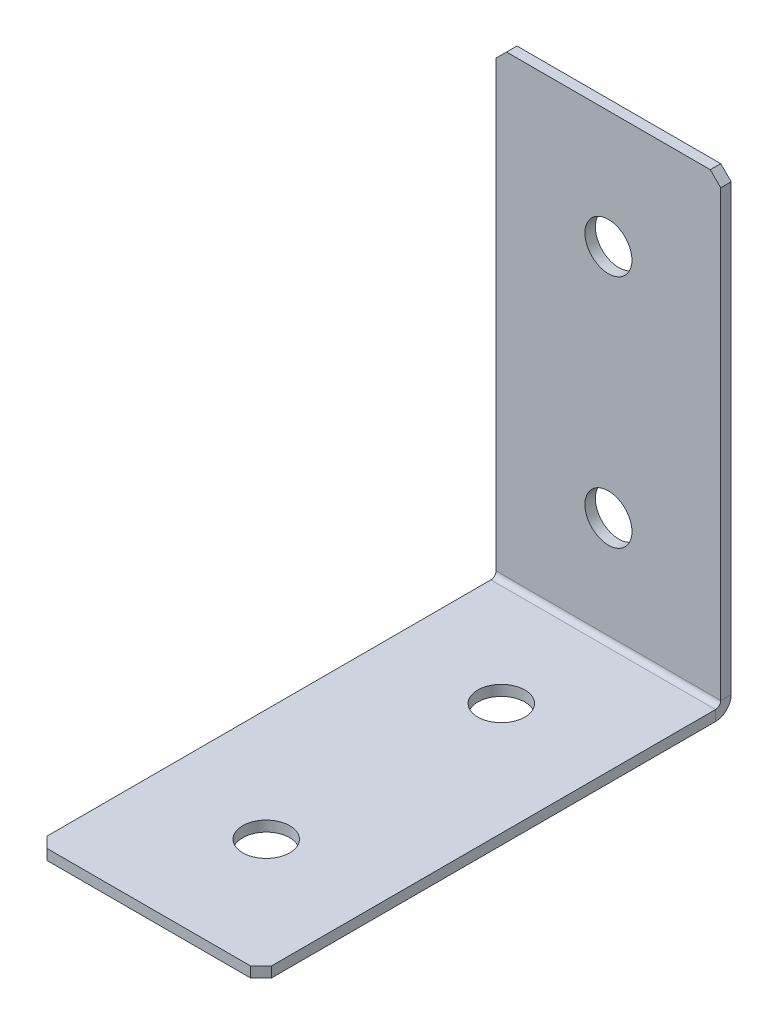
ISO-10303-21;
HEADER;
FILE_DESCRIPTION(('STEP AP214'),'2;1');
FILE_NAME('part.step','',(''),(''),'','','');
FILE_SCHEMA(('AUTOMOTIVE_DESIGN { 1 0 10303 214 1 1 1 1 }'));
ENDSEC;
DATA;
#1=APPLICATION_CONTEXT('core data for automotive mechanical design processes');
#2=APPLICATION_PROTOCOL_DEFINITION('international standard','automotive_design',2000,#1);
#3=PRODUCT_CONTEXT('',#1,'mechanical');
#4=PRODUCT('Part','Part','',(#3));
#5=PRODUCT_RELATED_PRODUCT_CATEGORY('part','',(#4));
#6=PRODUCT_DEFINITION_FORMATION('','',#4);
#7=PRODUCT_DEFINITION_CONTEXT('part definition',#1,'design');
#8=PRODUCT_DEFINITION('design','',#6,#7);
#9=PRODUCT_DEFINITION_SHAPE('','',#8);
#10=(LENGTH_UNIT() NAMED_UNIT(*) SI_UNIT(.MILLI.,.METRE.));
#11=(NAMED_UNIT(*) PLANE_ANGLE_UNIT() SI_UNIT($,.RADIAN.));
#12=(NAMED_UNIT(*) SI_UNIT($,.STERADIAN.) SOLID_ANGLE_UNIT());
#13=UNCERTAINTY_MEASURE_WITH_UNIT(LENGTH_MEASURE(1.E-05),#10,'distance_accuracy_value','');
#14=(GEOMETRIC_REPRESENTATION_CONTEXT(3) GLOBAL_UNCERTAINTY_ASSIGNED_CONTEXT((#13)) GLOBAL_UNIT_ASSIGNED_CONTEXT((#10,
#11,#12)) REPRESENTATION_CONTEXT('',''));
#15=CARTESIAN_POINT('',(0.,0.,0.));
#16=DIRECTION('',(0.,0.,1.));
#17=DIRECTION('',(1.,0.,0.));
#18=AXIS2_PLACEMENT_3D('',#15,#16,#17);
#19=CARTESIAN_POINT('',(0.,0.,2.));
#20=DIRECTION('',(0.,0.,-1.));
#21=DIRECTION('',(-1.,0.,0.));
#22=AXIS2_PLACEMENT_3D('',#19,#20,#21);
#23=PLANE('',#22);
#24=DIRECTION('',(0.,1.,0.));
#25=VECTOR('',#24,1.);
#26=CARTESIAN_POINT('',(21.5,0.,2.));
#27=LINE('',#26,#25);
#28=CARTESIAN_POINT('',(21.5,3.,2.));
#29=VERTEX_POINT('',#28);
#30=CARTESIAN_POINT('',(21.5,88.,2.));
#31=VERTEX_POINT('',#30);
#32=EDGE_CURVE('E252',#29,#31,#27,.T.);
#33=ORIENTED_EDGE('',*,*,#32,.T.);
#34=DIRECTION('',(0.707106781186552,-0.707106781186543,0.));
#35=VECTOR('',#34,1.);
#36=CARTESIAN_POINT('',(21.5,88.,2.));
#37=LINE('',#36,#35);
#38=CARTESIAN_POINT('',(19.5,90.,2.));
#39=VERTEX_POINT('',#38);
#40=EDGE_CURVE('E301',#31,#39,#37,.F.);
#41=ORIENTED_EDGE('',*,*,#40,.T.);
#42=DIRECTION('',(-1.,0.,0.));
#43=VECTOR('',#42,1.);
#44=CARTESIAN_POINT('',(-21.5,90.,2.));
#45=LINE('',#44,#43);
#46=CARTESIAN_POINT('',(-19.5,90.,2.));
#47=VERTEX_POINT('',#46);
#48=EDGE_CURVE('E257',#39,#47,#45,.T.);
#49=ORIENTED_EDGE('',*,*,#48,.T.);
#50=DIRECTION('',(0.707106781186545,0.70710678118655,0.));
#51=VECTOR('',#50,1.);
#52=CARTESIAN_POINT('',(-19.5,90.,2.));
#53=LINE('',#52,#51);
#54=CARTESIAN_POINT('',(-21.5,88.,2.));
#55=VERTEX_POINT('',#54);
#56=EDGE_CURVE('E298',#47,#55,#53,.F.);
#57=ORIENTED_EDGE('',*,*,#56,.T.);
#58=DIRECTION('',(0.,-1.,0.));
#59=VECTOR('',#58,1.);
#60=CARTESIAN_POINT('',(-21.5,0.,2.));
#61=LINE('',#60,#59);
#62=CARTESIAN_POINT('',(-21.5,3.,2.));
#63=VERTEX_POINT('',#62);
#64=EDGE_CURVE('E249',#55,#63,#61,.T.);
#65=ORIENTED_EDGE('',*,*,#64,.T.);
#66=DIRECTION('',(1.,0.,0.));
#67=VECTOR('',#66,1.);
#68=CARTESIAN_POINT('',(21.5,3.,2.));
#69=LINE('',#68,#67);
#70=EDGE_CURVE('E236',#29,#63,#69,.F.);
#71=ORIENTED_EDGE('',*,*,#70,.F.);
#72=EDGE_LOOP('',(#33,#41,#49,#57,#65,#71));
#73=FACE_BOUND('',#72,.T.);
#74=CARTESIAN_POINT('',(0.,67.5,2.));
#75=DIRECTION('',(0.,0.,1.));
#76=DIRECTION('',(1.,0.,0.));
#77=AXIS2_PLACEMENT_3D('',#74,#75,#76);
#78=CIRCLE('',#77,4.5);
#79=CARTESIAN_POINT('',(4.5,67.5,2.));
#80=VERTEX_POINT('',#79);
#81=EDGE_CURVE('E681',#80,#80,#78,.T.);
#82=ORIENTED_EDGE('',*,*,#81,.F.);
#83=EDGE_LOOP('',(#82));
#84=FACE_BOUND('',#83,.T.);
#85=CARTESIAN_POINT('',(0.,22.5,2.));
#86=DIRECTION('',(0.,0.,1.));
#87=DIRECTION('',(1.,0.,0.));
#88=AXIS2_PLACEMENT_3D('',#85,#86,#87);
#89=CIRCLE('',#88,4.5);
#90=CARTESIAN_POINT('',(4.5,22.5,2.));
#91=VERTEX_POINT('',#90);
#92=EDGE_CURVE('E664',#91,#91,#89,.T.);
#93=ORIENTED_EDGE('',*,*,#92,.F.);
#94=EDGE_LOOP('',(#93));
#95=FACE_BOUND('',#94,.T.);
#96=ADVANCED_FACE('F68',(#73,#84,#95),#23,.F.);
#97=CARTESIAN_POINT('',(21.5,0.,2.));
#98=DIRECTION('',(-1.,0.,0.));
#99=DIRECTION('',(0.,1.,0.));
#100=AXIS2_PLACEMENT_3D('',#97,#98,#99);
#101=PLANE('',#100);
#102=DIRECTION('',(0.,1.,0.));
#103=VECTOR('',#102,1.);
#104=CARTESIAN_POINT('',(21.5,0.,0.));
#105=LINE('',#104,#103);
#106=CARTESIAN_POINT('',(21.5,3.,0.));
#107=VERTEX_POINT('',#106);
#108=CARTESIAN_POINT('',(21.5,88.,0.));
#109=VERTEX_POINT('',#108);
#110=EDGE_CURVE('E264',#107,#109,#105,.T.);
#111=ORIENTED_EDGE('',*,*,#110,.T.);
#112=DIRECTION('',(0.,0.,-1.));
#113=VECTOR('',#112,1.);
#114=CARTESIAN_POINT('',(21.5,88.,2.));
#115=LINE('',#114,#113);
#116=EDGE_CURVE('E294',#109,#31,#115,.F.);
#117=ORIENTED_EDGE('',*,*,#116,.T.);
#118=ORIENTED_EDGE('',*,*,#32,.F.);
#119=DIRECTION('',(0.,0.,-1.));
#120=VECTOR('',#119,1.);
#121=CARTESIAN_POINT('',(21.5,3.,2.));
#122=LINE('',#121,#120);
#123=EDGE_CURVE('E231',#29,#107,#122,.T.);
#124=ORIENTED_EDGE('',*,*,#123,.T.);
#125=EDGE_LOOP('',(#111,#117,#118,#124));
#126=FACE_BOUND('',#125,.T.);
#127=ADVANCED_FACE('F322',(#126),#101,.F.);
#128=CARTESIAN_POINT('',(0.,0.,0.));
#129=DIRECTION('',(0.,0.,-1.));
#130=DIRECTION('',(-1.,0.,0.));
#131=AXIS2_PLACEMENT_3D('',#128,#129,#130);
#132=PLANE('',#131);
#133=CARTESIAN_POINT('',(0.,22.5,0.));
#134=DIRECTION('',(0.,0.,-1.));
#135=DIRECTION('',(-1.,0.,0.));
#136=AXIS2_PLACEMENT_3D('',#133,#134,#135);
#137=CIRCLE('',#136,4.5);
#138=CARTESIAN_POINT('',(-4.5,22.5,0.));
#139=VERTEX_POINT('',#138);
#140=EDGE_CURVE('E672',#139,#139,#137,.T.);
#141=ORIENTED_EDGE('',*,*,#140,.F.);
#142=EDGE_LOOP('',(#141));
#143=FACE_BOUND('',#142,.T.);
#144=CARTESIAN_POINT('',(0.,67.5,0.));
#145=DIRECTION('',(0.,0.,-1.));
#146=DIRECTION('',(-1.,0.,0.));
#147=AXIS2_PLACEMENT_3D('',#144,#145,#146);
#148=CIRCLE('',#147,4.5);
#149=CARTESIAN_POINT('',(-4.5,67.5,0.));
#150=VERTEX_POINT('',#149);
#151=EDGE_CURVE('E226',#150,#150,#148,.T.);
#152=ORIENTED_EDGE('',*,*,#151,.F.);
#153=EDGE_LOOP('',(#152));
#154=FACE_BOUND('',#153,.T.);
#155=DIRECTION('',(-1.,0.,0.));
#156=VECTOR('',#155,1.);
#157=CARTESIAN_POINT('',(0.,90.,0.));
#158=LINE('',#157,#156);
#159=CARTESIAN_POINT('',(19.5,90.,0.));
#160=VERTEX_POINT('',#159);
#161=CARTESIAN_POINT('',(-19.5,90.,0.));
#162=VERTEX_POINT('',#161);
#163=EDGE_CURVE('E253',#160,#162,#158,.T.);
#164=ORIENTED_EDGE('',*,*,#163,.F.);
#165=DIRECTION('',(-0.707106781186552,0.707106781186543,0.));
#166=VECTOR('',#165,1.);
#167=CARTESIAN_POINT('',(54.7499999999999,54.7500000000006,0.));
#168=LINE('',#167,#166);
#169=EDGE_CURVE('E78',#160,#109,#168,.F.);
#170=ORIENTED_EDGE('',*,*,#169,.T.);
#171=ORIENTED_EDGE('',*,*,#110,.F.);
#172=DIRECTION('',(1.,0.,0.));
#173=VECTOR('',#172,1.);
#174=CARTESIAN_POINT('',(21.5,3.,0.));
#175=LINE('',#174,#173);
#176=CARTESIAN_POINT('',(-21.5,3.00000000000001,0.));
#177=VERTEX_POINT('',#176);
#178=EDGE_CURVE('E167',#107,#177,#175,.F.);
#179=ORIENTED_EDGE('',*,*,#178,.T.);
#180=DIRECTION('',(0.,1.,0.));
#181=VECTOR('',#180,1.);
#182=CARTESIAN_POINT('',(-21.5,0.,0.));
#183=LINE('',#182,#181);
#184=CARTESIAN_POINT('',(-21.5,88.,0.));
#185=VERTEX_POINT('',#184);
#186=EDGE_CURVE('E246',#185,#177,#183,.F.);
#187=ORIENTED_EDGE('',*,*,#186,.F.);
#188=DIRECTION('',(-0.707106781186545,-0.70710678118655,0.));
#189=VECTOR('',#188,1.);
#190=CARTESIAN_POINT('',(-54.7500000000001,54.7499999999997,0.));
#191=LINE('',#190,#189);
#192=EDGE_CURVE('E90',#185,#162,#191,.F.);
#193=ORIENTED_EDGE('',*,*,#192,.T.);
#194=EDGE_LOOP('',(#164,#170,#171,#179,#187,#193));
#195=FACE_BOUND('',#194,.T.);
#196=ADVANCED_FACE('F317',(#143,#154,#195),#132,.T.);
#197=CARTESIAN_POINT('',(-21.5,90.,2.));
#198=DIRECTION('',(0.,-1.,0.));
#199=DIRECTION('',(-1.,0.,0.));
#200=AXIS2_PLACEMENT_3D('',#197,#198,#199);
#201=PLANE('',#200);
#202=ORIENTED_EDGE('',*,*,#48,.F.);
#203=DIRECTION('',(0.,0.,1.));
#204=VECTOR('',#203,1.);
#205=CARTESIAN_POINT('',(19.5,90.,2.));
#206=LINE('',#205,#204);
#207=EDGE_CURVE('E308',#39,#160,#206,.F.);
#208=ORIENTED_EDGE('',*,*,#207,.T.);
#209=ORIENTED_EDGE('',*,*,#163,.T.);
#210=DIRECTION('',(0.,0.,-1.));
#211=VECTOR('',#210,1.);
#212=CARTESIAN_POINT('',(-19.5,90.,2.));
#213=LINE('',#212,#211);
#214=EDGE_CURVE('E304',#162,#47,#213,.F.);
#215=ORIENTED_EDGE('',*,*,#214,.T.);
#216=EDGE_LOOP('',(#202,#208,#209,#215));
#217=FACE_BOUND('',#216,.T.);
#218=ADVANCED_FACE('F330',(#217),#201,.F.);
#219=CARTESIAN_POINT('',(-21.5,0.,2.));
#220=DIRECTION('',(1.,0.,0.));
#221=DIRECTION('',(0.,-1.,0.));
#222=AXIS2_PLACEMENT_3D('',#219,#220,#221);
#223=PLANE('',#222);
#224=ORIENTED_EDGE('',*,*,#64,.F.);
#225=DIRECTION('',(0.,0.,1.));
#226=VECTOR('',#225,1.);
#227=CARTESIAN_POINT('',(-21.5,88.,2.));
#228=LINE('',#227,#226);
#229=EDGE_CURVE('E13',#55,#185,#228,.F.);
#230=ORIENTED_EDGE('',*,*,#229,.T.);
#231=ORIENTED_EDGE('',*,*,#186,.T.);
#232=DIRECTION('',(0.,0.,-1.));
#233=VECTOR('',#232,1.);
#234=CARTESIAN_POINT('',(-21.5,3.,2.));
#235=LINE('',#234,#233);
#236=EDGE_CURVE('E242',#63,#177,#235,.T.);
#237=ORIENTED_EDGE('',*,*,#236,.F.);
#238=EDGE_LOOP('',(#224,#230,#231,#237));
#239=FACE_BOUND('',#238,.T.);
#240=ADVANCED_FACE('F334',(#239),#223,.F.);
#241=CARTESIAN_POINT('',(-21.5,3.,3.));
#242=DIRECTION('',(-1.,0.,0.));
#243=DIRECTION('',(0.,0.,1.));
#244=AXIS2_PLACEMENT_3D('',#241,#242,#243);
#245=PLANE('',#244);
#246=DIRECTION('',(0.,1.,0.));
#247=VECTOR('',#246,1.);
#248=CARTESIAN_POINT('',(-21.5,0.,2.99999999999999));
#249=LINE('',#248,#247);
#250=CARTESIAN_POINT('',(-21.5,2.,3.));
#251=VERTEX_POINT('',#250);
#252=CARTESIAN_POINT('',(-21.5,0.,2.99999999999999));
#253=VERTEX_POINT('',#252);
#254=EDGE_CURVE('E222',#251,#253,#249,.F.);
#255=ORIENTED_EDGE('',*,*,#254,.F.);
#256=CARTESIAN_POINT('',(-21.5,3.,3.));
#257=DIRECTION('',(1.,0.,0.));
#258=DIRECTION('',(0.,0.,-1.));
#259=AXIS2_PLACEMENT_3D('',#256,#257,#258);
#260=CIRCLE('',#259,1.);
#261=EDGE_CURVE('E171',#63,#251,#260,.F.);
#262=ORIENTED_EDGE('',*,*,#261,.F.);
#263=ORIENTED_EDGE('',*,*,#236,.T.);
#264=CARTESIAN_POINT('',(-21.5,3.,3.));
#265=DIRECTION('',(1.,0.,0.));
#266=DIRECTION('',(0.,0.,-1.));
#267=AXIS2_PLACEMENT_3D('',#264,#265,#266);
#268=CIRCLE('',#267,3.);
#269=EDGE_CURVE('E229',#177,#253,#268,.F.);
#270=ORIENTED_EDGE('',*,*,#269,.T.);
#271=EDGE_LOOP('',(#255,#262,#263,#270));
#272=FACE_BOUND('',#271,.T.);
#273=ADVANCED_FACE('F338',(#272),#245,.T.);
#274=CARTESIAN_POINT('',(21.5,3.,3.));
#275=DIRECTION('',(-1.,0.,0.));
#276=DIRECTION('',(0.,0.,1.));
#277=AXIS2_PLACEMENT_3D('',#274,#275,#276);
#278=PLANE('',#277);
#279=CARTESIAN_POINT('',(21.5,3.,3.));
#280=DIRECTION('',(1.,0.,0.));
#281=DIRECTION('',(0.,0.,-1.));
#282=AXIS2_PLACEMENT_3D('',#279,#280,#281);
#283=CIRCLE('',#282,1.);
#284=CARTESIAN_POINT('',(21.5,2.,3.));
#285=VERTEX_POINT('',#284);
#286=EDGE_CURVE('E178',#285,#29,#283,.T.);
#287=ORIENTED_EDGE('',*,*,#286,.F.);
#288=DIRECTION('',(0.,1.,0.));
#289=VECTOR('',#288,1.);
#290=CARTESIAN_POINT('',(21.5,2.,3.));
#291=LINE('',#290,#289);
#292=CARTESIAN_POINT('',(21.5,0.,2.99999999999999));
#293=VERTEX_POINT('',#292);
#294=EDGE_CURVE('E175',#285,#293,#291,.F.);
#295=ORIENTED_EDGE('',*,*,#294,.T.);
#296=CARTESIAN_POINT('',(21.5,3.,3.));
#297=DIRECTION('',(1.,0.,0.));
#298=DIRECTION('',(0.,0.,-1.));
#299=AXIS2_PLACEMENT_3D('',#296,#297,#298);
#300=CIRCLE('',#299,3.);
#301=EDGE_CURVE('E159',#293,#107,#300,.T.);
#302=ORIENTED_EDGE('',*,*,#301,.T.);
#303=ORIENTED_EDGE('',*,*,#123,.F.);
#304=EDGE_LOOP('',(#287,#295,#302,#303));
#305=FACE_BOUND('',#304,.T.);
#306=ADVANCED_FACE('F176',(#305),#278,.F.);
#307=CARTESIAN_POINT('',(21.5,3.,3.));
#308=DIRECTION('',(1.,0.,0.));
#309=DIRECTION('',(0.,-1.,0.));
#310=AXIS2_PLACEMENT_3D('',#307,#308,#309);
#311=CYLINDRICAL_SURFACE('',#310,3.);
#312=ORIENTED_EDGE('',*,*,#178,.F.);
#313=ORIENTED_EDGE('',*,*,#301,.F.);
#314=DIRECTION('',(1.,0.,0.));
#315=VECTOR('',#314,1.);
#316=CARTESIAN_POINT('',(-21.5,0.,2.99999999999999));
#317=LINE('',#316,#315);
#318=EDGE_CURVE('E164',#293,#253,#317,.F.);
#319=ORIENTED_EDGE('',*,*,#318,.T.);
#320=ORIENTED_EDGE('',*,*,#269,.F.);
#321=EDGE_LOOP('',(#312,#313,#319,#320));
#322=FACE_BOUND('',#321,.T.);
#323=ADVANCED_FACE('F161',(#322),#311,.T.);
#324=CARTESIAN_POINT('',(21.5,3.,3.));
#325=DIRECTION('',(1.,0.,0.));
#326=DIRECTION('',(0.,-1.,0.));
#327=AXIS2_PLACEMENT_3D('',#324,#325,#326);
#328=CYLINDRICAL_SURFACE('',#327,1.);
#329=ORIENTED_EDGE('',*,*,#70,.T.);
#330=ORIENTED_EDGE('',*,*,#261,.T.);
#331=DIRECTION('',(1.,0.,0.));
#332=VECTOR('',#331,1.);
#333=CARTESIAN_POINT('',(-21.5,2.,3.));
#334=LINE('',#333,#332);
#335=EDGE_CURVE('E184',#251,#285,#334,.T.);
#336=ORIENTED_EDGE('',*,*,#335,.T.);
#337=ORIENTED_EDGE('',*,*,#286,.T.);
#338=EDGE_LOOP('',(#329,#330,#336,#337));
#339=FACE_BOUND('',#338,.T.);
#340=ADVANCED_FACE('F341',(#339),#328,.F.);
#341=CARTESIAN_POINT('',(-21.5,0.,1.99999999999999));
#342=DIRECTION('',(1.,0.,0.));
#343=DIRECTION('',(0.,0.,-1.));
#344=AXIS2_PLACEMENT_3D('',#341,#342,#343);
#345=PLANE('',#344);
#346=DIRECTION('',(0.,0.,-1.));
#347=VECTOR('',#346,1.);
#348=CARTESIAN_POINT('',(-21.5,0.,0.));
#349=LINE('',#348,#347);
#350=CARTESIAN_POINT('',(-21.5,-3.00311463914289E-13,88.));
#351=VERTEX_POINT('',#350);
#352=EDGE_CURVE('E192',#351,#253,#349,.T.);
#353=ORIENTED_EDGE('',*,*,#352,.F.);
#354=DIRECTION('',(0.,1.,0.));
#355=VECTOR('',#354,1.);
#356=CARTESIAN_POINT('',(-21.5,-3.0026739514051E-13,88.));
#357=LINE('',#356,#355);
#358=CARTESIAN_POINT('',(-21.5,1.9999999999997,88.));
#359=VERTEX_POINT('',#358);
#360=EDGE_CURVE('E290',#351,#359,#357,.T.);
#361=ORIENTED_EDGE('',*,*,#360,.T.);
#362=DIRECTION('',(0.,0.,1.));
#363=VECTOR('',#362,1.);
#364=CARTESIAN_POINT('',(-21.5,2.,2.));
#365=LINE('',#364,#363);
#366=EDGE_CURVE('E194',#359,#251,#365,.F.);
#367=ORIENTED_EDGE('',*,*,#366,.T.);
#368=ORIENTED_EDGE('',*,*,#254,.T.);
#369=EDGE_LOOP('',(#353,#361,#367,#368));
#370=FACE_BOUND('',#369,.T.);
#371=ADVANCED_FACE('F358',(#370),#345,.F.);
#372=CARTESIAN_POINT('',(21.5,-3.07046055247895E-13,90.));
#373=DIRECTION('',(-1.,0.,0.));
#374=DIRECTION('',(0.,0.,1.));
#375=AXIS2_PLACEMENT_3D('',#372,#373,#374);
#376=PLANE('',#375);
#377=DIRECTION('',(0.,0.,-1.));
#378=VECTOR('',#377,1.);
#379=CARTESIAN_POINT('',(21.5,1.99999999999969,90.));
#380=LINE('',#379,#378);
#381=CARTESIAN_POINT('',(21.5,1.9999999999997,88.));
#382=VERTEX_POINT('',#381);
#383=EDGE_CURVE('E215',#285,#382,#380,.F.);
#384=ORIENTED_EDGE('',*,*,#383,.T.);
#385=DIRECTION('',(0.,-1.,0.));
#386=VECTOR('',#385,1.);
#387=CARTESIAN_POINT('',(21.5,-3.00063092570209E-13,88.));
#388=LINE('',#387,#386);
#389=CARTESIAN_POINT('',(21.5,-3.00311463914289E-13,88.));
#390=VERTEX_POINT('',#389);
#391=EDGE_CURVE('E198',#382,#390,#388,.T.);
#392=ORIENTED_EDGE('',*,*,#391,.T.);
#393=DIRECTION('',(0.,0.,1.));
#394=VECTOR('',#393,1.);
#395=CARTESIAN_POINT('',(21.5,0.,0.));
#396=LINE('',#395,#394);
#397=EDGE_CURVE('E189',#293,#390,#396,.T.);
#398=ORIENTED_EDGE('',*,*,#397,.F.);
#399=ORIENTED_EDGE('',*,*,#294,.F.);
#400=EDGE_LOOP('',(#384,#392,#398,#399));
#401=FACE_BOUND('',#400,.T.);
#402=ADVANCED_FACE('F196',(#401),#376,.F.);
#403=CARTESIAN_POINT('',(0.,0.,0.));
#404=DIRECTION('',(0.,1.,0.));
#405=DIRECTION('',(0.,0.,1.));
#406=AXIS2_PLACEMENT_3D('',#403,#404,#405);
#407=PLANE('',#406);
#408=CARTESIAN_POINT('',(0.,0.,22.5));
#409=DIRECTION('',(0.,1.,0.));
#410=DIRECTION('',(0.,0.,1.));
#411=AXIS2_PLACEMENT_3D('',#408,#409,#410);
#412=CIRCLE('',#411,4.5);
#413=CARTESIAN_POINT('',(0.,0.,27.));
#414=VERTEX_POINT('',#413);
#415=EDGE_CURVE('E659',#414,#414,#412,.T.);
#416=ORIENTED_EDGE('',*,*,#415,.T.);
#417=EDGE_LOOP('',(#416));
#418=FACE_BOUND('',#417,.T.);
#419=CARTESIAN_POINT('',(0.,-2.28549817959944E-13,67.5));
#420=DIRECTION('',(0.,1.,0.));
#421=DIRECTION('',(0.,0.,1.));
#422=AXIS2_PLACEMENT_3D('',#419,#420,#421);
#423=CIRCLE('',#422,4.5);
#424=CARTESIAN_POINT('',(0.,-2.44261483984738E-13,72.));
#425=VERTEX_POINT('',#424);
#426=EDGE_CURVE('E662',#425,#425,#423,.T.);
#427=ORIENTED_EDGE('',*,*,#426,.T.);
#428=EDGE_LOOP('',(#427));
#429=FACE_BOUND('',#428,.T.);
#430=ORIENTED_EDGE('',*,*,#397,.T.);
#431=DIRECTION('',(0.707106781186546,0.,-0.707106781186549));
#432=VECTOR('',#431,1.);
#433=CARTESIAN_POINT('',(19.5,-3.07046055247895E-13,90.));
#434=LINE('',#433,#432);
#435=CARTESIAN_POINT('',(19.5,-3.07294426591975E-13,90.));
#436=VERTEX_POINT('',#435);
#437=EDGE_CURVE('E287',#390,#436,#434,.F.);
#438=ORIENTED_EDGE('',*,*,#437,.T.);
#439=DIRECTION('',(-1.,0.,0.));
#440=VECTOR('',#439,1.);
#441=CARTESIAN_POINT('',(0.,-3.07294426591975E-13,90.));
#442=LINE('',#441,#440);
#443=CARTESIAN_POINT('',(-19.5,-3.07294426591975E-13,90.));
#444=VERTEX_POINT('',#443);
#445=EDGE_CURVE('E200',#436,#444,#442,.T.);
#446=ORIENTED_EDGE('',*,*,#445,.T.);
#447=DIRECTION('',(0.707106781186552,0.,0.707106781186543));
#448=VECTOR('',#447,1.);
#449=CARTESIAN_POINT('',(-21.5,-3.0026739514051E-13,88.));
#450=LINE('',#449,#448);
#451=EDGE_CURVE('E284',#444,#351,#450,.F.);
#452=ORIENTED_EDGE('',*,*,#451,.T.);
#453=ORIENTED_EDGE('',*,*,#352,.T.);
#454=ORIENTED_EDGE('',*,*,#318,.F.);
#455=EDGE_LOOP('',(#430,#438,#446,#452,#453,#454));
#456=FACE_BOUND('',#455,.T.);
#457=ADVANCED_FACE('F188',(#418,#429,#456),#407,.F.);
#458=CARTESIAN_POINT('',(0.,2.00000000000001,0.));
#459=DIRECTION('',(0.,1.,0.));
#460=DIRECTION('',(0.,0.,1.));
#461=AXIS2_PLACEMENT_3D('',#458,#459,#460);
#462=PLANE('',#461);
#463=CARTESIAN_POINT('',(0.,1.99999999999993,22.5));
#464=DIRECTION('',(0.,1.,0.));
#465=DIRECTION('',(0.,0.,1.));
#466=AXIS2_PLACEMENT_3D('',#463,#464,#465);
#467=CIRCLE('',#466,4.5);
#468=CARTESIAN_POINT('',(0.,1.99999999999991,27.));
#469=VERTEX_POINT('',#468);
#470=EDGE_CURVE('E716',#469,#469,#467,.T.);
#471=ORIENTED_EDGE('',*,*,#470,.F.);
#472=EDGE_LOOP('',(#471));
#473=FACE_BOUND('',#472,.T.);
#474=CARTESIAN_POINT('',(0.,1.99999999999977,67.5));
#475=DIRECTION('',(0.,1.,0.));
#476=DIRECTION('',(0.,0.,1.));
#477=AXIS2_PLACEMENT_3D('',#474,#475,#476);
#478=CIRCLE('',#477,4.5);
#479=CARTESIAN_POINT('',(0.,1.99999999999976,72.));
#480=VERTEX_POINT('',#479);
#481=EDGE_CURVE('E665',#480,#480,#478,.T.);
#482=ORIENTED_EDGE('',*,*,#481,.F.);
#483=EDGE_LOOP('',(#482));
#484=FACE_BOUND('',#483,.T.);
#485=DIRECTION('',(1.,0.,0.));
#486=VECTOR('',#485,1.);
#487=CARTESIAN_POINT('',(-21.5,1.99999999999969,90.));
#488=LINE('',#487,#486);
#489=CARTESIAN_POINT('',(19.5,1.99999999999969,90.));
#490=VERTEX_POINT('',#489);
#491=CARTESIAN_POINT('',(-19.5,1.99999999999969,90.));
#492=VERTEX_POINT('',#491);
#493=EDGE_CURVE('E208',#490,#492,#488,.F.);
#494=ORIENTED_EDGE('',*,*,#493,.F.);
#495=DIRECTION('',(-0.707106781186546,0.,0.707106781186549));
#496=VECTOR('',#495,1.);
#497=CARTESIAN_POINT('',(54.75,1.99999999999982,54.7499999999998));
#498=LINE('',#497,#496);
#499=EDGE_CURVE('E279',#490,#382,#498,.F.);
#500=ORIENTED_EDGE('',*,*,#499,.T.);
#501=ORIENTED_EDGE('',*,*,#383,.F.);
#502=ORIENTED_EDGE('',*,*,#335,.F.);
#503=ORIENTED_EDGE('',*,*,#366,.F.);
#504=DIRECTION('',(-0.707106781186552,0.,-0.707106781186543));
#505=VECTOR('',#504,1.);
#506=CARTESIAN_POINT('',(-54.7499999999999,1.99999999999982,54.7500000000006));
#507=LINE('',#506,#505);
#508=EDGE_CURVE('E276',#359,#492,#507,.F.);
#509=ORIENTED_EDGE('',*,*,#508,.T.);
#510=EDGE_LOOP('',(#494,#500,#501,#502,#503,#509));
#511=FACE_BOUND('',#510,.T.);
#512=ADVANCED_FACE('F345',(#473,#484,#511),#462,.T.);
#513=CARTESIAN_POINT('',(-21.5,-3.07046055247895E-13,90.));
#514=DIRECTION('',(0.,0.,-1.));
#515=DIRECTION('',(0.,1.,0.));
#516=AXIS2_PLACEMENT_3D('',#513,#514,#515);
#517=PLANE('',#516);
#518=ORIENTED_EDGE('',*,*,#445,.F.);
#519=DIRECTION('',(0.,1.,0.));
#520=VECTOR('',#519,1.);
#521=CARTESIAN_POINT('',(19.5,-3.07046055247895E-13,90.));
#522=LINE('',#521,#520);
#523=EDGE_CURVE('E272',#436,#490,#522,.T.);
#524=ORIENTED_EDGE('',*,*,#523,.T.);
#525=ORIENTED_EDGE('',*,*,#493,.T.);
#526=DIRECTION('',(0.,-1.,0.));
#527=VECTOR('',#526,1.);
#528=CARTESIAN_POINT('',(-19.5,-3.07046055247895E-13,90.));
#529=LINE('',#528,#527);
#530=EDGE_CURVE('E261',#492,#444,#529,.T.);
#531=ORIENTED_EDGE('',*,*,#530,.T.);
#532=EDGE_LOOP('',(#518,#524,#525,#531));
#533=FACE_BOUND('',#532,.T.);
#534=ADVANCED_FACE('F352',(#533),#517,.F.);
#535=CARTESIAN_POINT('',(0.,67.5,2.));
#536=DIRECTION('',(0.,0.,1.));
#537=DIRECTION('',(1.,0.,0.));
#538=AXIS2_PLACEMENT_3D('',#535,#536,#537);
#539=CYLINDRICAL_SURFACE('',#538,4.5);
#540=ORIENTED_EDGE('',*,*,#81,.T.);
#541=EDGE_LOOP('',(#540));
#542=FACE_BOUND('',#541,.T.);
#543=ORIENTED_EDGE('',*,*,#151,.T.);
#544=EDGE_LOOP('',(#543));
#545=FACE_BOUND('',#544,.T.);
#546=ADVANCED_FACE('F442',(#542,#545),#539,.F.);
#547=CARTESIAN_POINT('',(0.,22.5,2.));
#548=DIRECTION('',(0.,0.,1.));
#549=DIRECTION('',(1.,0.,0.));
#550=AXIS2_PLACEMENT_3D('',#547,#548,#549);
#551=CYLINDRICAL_SURFACE('',#550,4.5);
#552=ORIENTED_EDGE('',*,*,#92,.T.);
#553=EDGE_LOOP('',(#552));
#554=FACE_BOUND('',#553,.T.);
#555=ORIENTED_EDGE('',*,*,#140,.T.);
#556=EDGE_LOOP('',(#555));
#557=FACE_BOUND('',#556,.T.);
#558=ADVANCED_FACE('F433',(#554,#557),#551,.F.);
#559=CARTESIAN_POINT('',(0.,1.99999999999977,67.5));
#560=DIRECTION('',(0.,1.,0.));
#561=DIRECTION('',(0.,0.,1.));
#562=AXIS2_PLACEMENT_3D('',#559,#560,#561);
#563=CYLINDRICAL_SURFACE('',#562,4.5);
#564=ORIENTED_EDGE('',*,*,#426,.F.);
#565=EDGE_LOOP('',(#564));
#566=FACE_BOUND('',#565,.T.);
#567=ORIENTED_EDGE('',*,*,#481,.T.);
#568=EDGE_LOOP('',(#567));
#569=FACE_BOUND('',#568,.T.);
#570=ADVANCED_FACE('F424',(#566,#569),#563,.F.);
#571=CARTESIAN_POINT('',(0.,1.99999999999993,22.5));
#572=DIRECTION('',(0.,1.,0.));
#573=DIRECTION('',(0.,0.,1.));
#574=AXIS2_PLACEMENT_3D('',#571,#572,#573);
#575=CYLINDRICAL_SURFACE('',#574,4.5);
#576=ORIENTED_EDGE('',*,*,#415,.F.);
#577=EDGE_LOOP('',(#576));
#578=FACE_BOUND('',#577,.T.);
#579=ORIENTED_EDGE('',*,*,#470,.T.);
#580=EDGE_LOOP('',(#579));
#581=FACE_BOUND('',#580,.T.);
#582=ADVANCED_FACE('F390',(#578,#581),#575,.F.);
#583=CARTESIAN_POINT('',(19.5,-3.07046055247895E-13,90.));
#584=DIRECTION('',(-0.707106781186549,0.,-0.707106781186546));
#585=DIRECTION('',(0.,1.,0.));
#586=AXIS2_PLACEMENT_3D('',#583,#584,#585);
#587=PLANE('',#586);
#588=ORIENTED_EDGE('',*,*,#437,.F.);
#589=ORIENTED_EDGE('',*,*,#391,.F.);
#590=ORIENTED_EDGE('',*,*,#499,.F.);
#591=ORIENTED_EDGE('',*,*,#523,.F.);
#592=EDGE_LOOP('',(#588,#589,#590,#591));
#593=FACE_BOUND('',#592,.T.);
#594=ADVANCED_FACE('F347',(#593),#587,.F.);
#595=CARTESIAN_POINT('',(-21.5,-3.0026739514051E-13,88.));
#596=DIRECTION('',(0.707106781186543,0.,-0.707106781186552));
#597=DIRECTION('',(0.,1.,0.));
#598=AXIS2_PLACEMENT_3D('',#595,#596,#597);
#599=PLANE('',#598);
#600=ORIENTED_EDGE('',*,*,#451,.F.);
#601=ORIENTED_EDGE('',*,*,#530,.F.);
#602=ORIENTED_EDGE('',*,*,#508,.F.);
#603=ORIENTED_EDGE('',*,*,#360,.F.);
#604=EDGE_LOOP('',(#600,#601,#602,#603));
#605=FACE_BOUND('',#604,.T.);
#606=ADVANCED_FACE('F355',(#605),#599,.F.);
#607=CARTESIAN_POINT('',(21.5,88.,2.));
#608=DIRECTION('',(-0.707106781186543,-0.707106781186552,0.));
#609=DIRECTION('',(0.,0.,1.));
#610=AXIS2_PLACEMENT_3D('',#607,#608,#609);
#611=PLANE('',#610);
#612=ORIENTED_EDGE('',*,*,#169,.F.);
#613=ORIENTED_EDGE('',*,*,#207,.F.);
#614=ORIENTED_EDGE('',*,*,#40,.F.);
#615=ORIENTED_EDGE('',*,*,#116,.F.);
#616=EDGE_LOOP('',(#612,#613,#614,#615));
#617=FACE_BOUND('',#616,.T.);
#618=ADVANCED_FACE('F324',(#617),#611,.F.);
#619=CARTESIAN_POINT('',(-19.5,90.,2.));
#620=DIRECTION('',(0.70710678118655,-0.707106781186545,0.));
#621=DIRECTION('',(0.,0.,1.));
#622=AXIS2_PLACEMENT_3D('',#619,#620,#621);
#623=PLANE('',#622);
#624=ORIENTED_EDGE('',*,*,#192,.F.);
#625=ORIENTED_EDGE('',*,*,#229,.F.);
#626=ORIENTED_EDGE('',*,*,#56,.F.);
#627=ORIENTED_EDGE('',*,*,#214,.F.);
#628=EDGE_LOOP('',(#624,#625,#626,#627));
#629=FACE_BOUND('',#628,.T.);
#630=ADVANCED_FACE('F71',(#629),#623,.F.);
#631=CLOSED_SHELL('',(#96,#127,#196,#218,#240,#273,#306,#323,#340,#371,#402,#457,#512,#534,#546,
#558,#570,#582,#594,#606,#618,#630));
#632=MANIFOLD_SOLID_BREP('B2',#631);
#633=ADVANCED_BREP_SHAPE_REPRESENTATION('',(#18,#632),#14);
#634=SHAPE_DEFINITION_REPRESENTATION(#9,#633);
ENDSEC;
END-ISO-10303-21;
